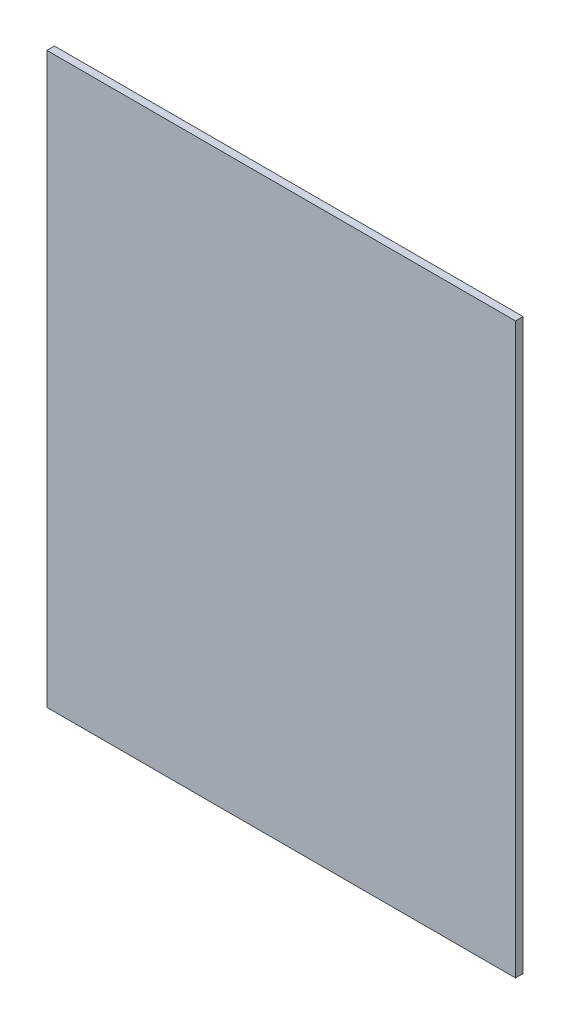
ISO-10303-21;
HEADER;
FILE_DESCRIPTION(('STEP AP214'),'2;1');
FILE_NAME('part.step','',(''),(''),'','','');
FILE_SCHEMA(('AUTOMOTIVE_DESIGN { 1 0 10303 214 1 1 1 1 }'));
ENDSEC;
DATA;
#1=APPLICATION_CONTEXT('core data for automotive mechanical design processes');
#2=APPLICATION_PROTOCOL_DEFINITION('international standard','automotive_design',2000,#1);
#3=PRODUCT_CONTEXT('',#1,'mechanical');
#4=PRODUCT('Part','Part','',(#3));
#5=PRODUCT_RELATED_PRODUCT_CATEGORY('part','',(#4));
#6=PRODUCT_DEFINITION_FORMATION('','',#4);
#7=PRODUCT_DEFINITION_CONTEXT('part definition',#1,'design');
#8=PRODUCT_DEFINITION('design','',#6,#7);
#9=PRODUCT_DEFINITION_SHAPE('','',#8);
#10=(LENGTH_UNIT() NAMED_UNIT(*) SI_UNIT(.MILLI.,.METRE.));
#11=(NAMED_UNIT(*) PLANE_ANGLE_UNIT() SI_UNIT($,.RADIAN.));
#12=(NAMED_UNIT(*) SI_UNIT($,.STERADIAN.) SOLID_ANGLE_UNIT());
#13=UNCERTAINTY_MEASURE_WITH_UNIT(LENGTH_MEASURE(1.E-05),#10,'distance_accuracy_value','');
#14=(GEOMETRIC_REPRESENTATION_CONTEXT(3) GLOBAL_UNCERTAINTY_ASSIGNED_CONTEXT((#13)) GLOBAL_UNIT_ASSIGNED_CONTEXT((#10,
#11,#12)) REPRESENTATION_CONTEXT('',''));
#15=CARTESIAN_POINT('',(0.,0.,0.));
#16=DIRECTION('',(0.,0.,1.));
#17=DIRECTION('',(1.,0.,0.));
#18=AXIS2_PLACEMENT_3D('',#15,#16,#17);
#19=CARTESIAN_POINT('',(98.425,-119.5,3.175));
#20=DIRECTION('',(-1.,0.,0.));
#21=DIRECTION('',(0.,0.,1.));
#22=AXIS2_PLACEMENT_3D('',#19,#20,#21);
#23=PLANE('',#22);
#24=DIRECTION('',(0.,1.,0.));
#25=VECTOR('',#24,1.);
#26=CARTESIAN_POINT('',(98.425,-119.5,0.));
#27=LINE('',#26,#25);
#28=CARTESIAN_POINT('',(98.425,-119.5,0.));
#29=VERTEX_POINT('',#28);
#30=CARTESIAN_POINT('',(98.425,119.5,0.));
#31=VERTEX_POINT('',#30);
#32=EDGE_CURVE('E118',#29,#31,#27,.T.);
#33=ORIENTED_EDGE('',*,*,#32,.T.);
#34=DIRECTION('',(0.,0.,-1.));
#35=VECTOR('',#34,1.);
#36=CARTESIAN_POINT('',(98.425,119.5,3.175));
#37=LINE('',#36,#35);
#38=CARTESIAN_POINT('',(98.425,119.5,3.175));
#39=VERTEX_POINT('',#38);
#40=EDGE_CURVE('E11',#39,#31,#37,.T.);
#41=ORIENTED_EDGE('',*,*,#40,.F.);
#42=DIRECTION('',(0.,1.,0.));
#43=VECTOR('',#42,1.);
#44=CARTESIAN_POINT('',(98.425,-119.5,3.175));
#45=LINE('',#44,#43);
#46=CARTESIAN_POINT('',(98.425,-119.5,3.175));
#47=VERTEX_POINT('',#46);
#48=EDGE_CURVE('E99',#47,#39,#45,.T.);
#49=ORIENTED_EDGE('',*,*,#48,.F.);
#50=DIRECTION('',(0.,0.,-1.));
#51=VECTOR('',#50,1.);
#52=CARTESIAN_POINT('',(98.425,-119.5,3.175));
#53=LINE('',#52,#51);
#54=EDGE_CURVE('E114',#47,#29,#53,.T.);
#55=ORIENTED_EDGE('',*,*,#54,.T.);
#56=EDGE_LOOP('',(#33,#41,#49,#55));
#57=FACE_BOUND('',#56,.T.);
#58=ADVANCED_FACE('F47',(#57),#23,.F.);
#59=CARTESIAN_POINT('',(-98.425,119.5,3.175));
#60=DIRECTION('',(0.,-1.,0.));
#61=DIRECTION('',(0.,0.,-1.));
#62=AXIS2_PLACEMENT_3D('',#59,#60,#61);
#63=PLANE('',#62);
#64=DIRECTION('',(-1.,0.,0.));
#65=VECTOR('',#64,1.);
#66=CARTESIAN_POINT('',(-98.425,119.5,0.));
#67=LINE('',#66,#65);
#68=CARTESIAN_POINT('',(-98.425,119.5,0.));
#69=VERTEX_POINT('',#68);
#70=EDGE_CURVE('E104',#31,#69,#67,.T.);
#71=ORIENTED_EDGE('',*,*,#70,.T.);
#72=DIRECTION('',(0.,0.,-1.));
#73=VECTOR('',#72,1.);
#74=CARTESIAN_POINT('',(-98.425,119.5,3.175));
#75=LINE('',#74,#73);
#76=CARTESIAN_POINT('',(-98.425,119.5,3.175));
#77=VERTEX_POINT('',#76);
#78=EDGE_CURVE('E56',#77,#69,#75,.T.);
#79=ORIENTED_EDGE('',*,*,#78,.F.);
#80=DIRECTION('',(-1.,0.,0.));
#81=VECTOR('',#80,1.);
#82=CARTESIAN_POINT('',(-98.425,119.5,3.175));
#83=LINE('',#82,#81);
#84=EDGE_CURVE('E94',#39,#77,#83,.T.);
#85=ORIENTED_EDGE('',*,*,#84,.F.);
#86=ORIENTED_EDGE('',*,*,#40,.T.);
#87=EDGE_LOOP('',(#71,#79,#85,#86));
#88=FACE_BOUND('',#87,.T.);
#89=ADVANCED_FACE('F103',(#88),#63,.F.);
#90=CARTESIAN_POINT('',(-98.425,-119.5,3.175));
#91=DIRECTION('',(1.,0.,0.));
#92=DIRECTION('',(0.,0.,-1.));
#93=AXIS2_PLACEMENT_3D('',#90,#91,#92);
#94=PLANE('',#93);
#95=DIRECTION('',(0.,-1.,0.));
#96=VECTOR('',#95,1.);
#97=CARTESIAN_POINT('',(-98.425,-119.5,0.));
#98=LINE('',#97,#96);
#99=CARTESIAN_POINT('',(-98.425,-119.5,0.));
#100=VERTEX_POINT('',#99);
#101=EDGE_CURVE('E81',#69,#100,#98,.T.);
#102=ORIENTED_EDGE('',*,*,#101,.T.);
#103=DIRECTION('',(0.,0.,-1.));
#104=VECTOR('',#103,1.);
#105=CARTESIAN_POINT('',(-98.425,-119.5,3.175));
#106=LINE('',#105,#104);
#107=CARTESIAN_POINT('',(-98.425,-119.5,3.175));
#108=VERTEX_POINT('',#107);
#109=EDGE_CURVE('E106',#108,#100,#106,.T.);
#110=ORIENTED_EDGE('',*,*,#109,.F.);
#111=DIRECTION('',(0.,-1.,0.));
#112=VECTOR('',#111,1.);
#113=CARTESIAN_POINT('',(-98.425,-119.5,3.175));
#114=LINE('',#113,#112);
#115=EDGE_CURVE('E97',#77,#108,#114,.T.);
#116=ORIENTED_EDGE('',*,*,#115,.F.);
#117=ORIENTED_EDGE('',*,*,#78,.T.);
#118=EDGE_LOOP('',(#102,#110,#116,#117));
#119=FACE_BOUND('',#118,.T.);
#120=ADVANCED_FACE('F107',(#119),#94,.F.);
#121=CARTESIAN_POINT('',(-98.425,-119.5,3.175));
#122=DIRECTION('',(0.,1.,0.));
#123=DIRECTION('',(0.,0.,1.));
#124=AXIS2_PLACEMENT_3D('',#121,#122,#123);
#125=PLANE('',#124);
#126=DIRECTION('',(1.,0.,0.));
#127=VECTOR('',#126,1.);
#128=CARTESIAN_POINT('',(-98.425,-119.5,0.));
#129=LINE('',#128,#127);
#130=EDGE_CURVE('E87',#100,#29,#129,.T.);
#131=ORIENTED_EDGE('',*,*,#130,.T.);
#132=ORIENTED_EDGE('',*,*,#54,.F.);
#133=DIRECTION('',(1.,0.,0.));
#134=VECTOR('',#133,1.);
#135=CARTESIAN_POINT('',(-98.425,-119.5,3.175));
#136=LINE('',#135,#134);
#137=EDGE_CURVE('E64',#108,#47,#136,.T.);
#138=ORIENTED_EDGE('',*,*,#137,.F.);
#139=ORIENTED_EDGE('',*,*,#109,.T.);
#140=EDGE_LOOP('',(#131,#132,#138,#139));
#141=FACE_BOUND('',#140,.T.);
#142=ADVANCED_FACE('F130',(#141),#125,.F.);
#143=CARTESIAN_POINT('',(0.,0.,3.175));
#144=DIRECTION('',(0.,0.,-1.));
#145=DIRECTION('',(-1.,0.,0.));
#146=AXIS2_PLACEMENT_3D('',#143,#144,#145);
#147=PLANE('',#146);
#148=ORIENTED_EDGE('',*,*,#48,.T.);
#149=ORIENTED_EDGE('',*,*,#84,.T.);
#150=ORIENTED_EDGE('',*,*,#115,.T.);
#151=ORIENTED_EDGE('',*,*,#137,.T.);
#152=EDGE_LOOP('',(#148,#149,#150,#151));
#153=FACE_BOUND('',#152,.T.);
#154=ADVANCED_FACE('F95',(#153),#147,.F.);
#155=CARTESIAN_POINT('',(0.,0.,0.));
#156=DIRECTION('',(0.,0.,-1.));
#157=DIRECTION('',(-1.,0.,0.));
#158=AXIS2_PLACEMENT_3D('',#155,#156,#157);
#159=PLANE('',#158);
#160=ORIENTED_EDGE('',*,*,#32,.F.);
#161=ORIENTED_EDGE('',*,*,#130,.F.);
#162=ORIENTED_EDGE('',*,*,#101,.F.);
#163=ORIENTED_EDGE('',*,*,#70,.F.);
#164=EDGE_LOOP('',(#160,#161,#162,#163));
#165=FACE_BOUND('',#164,.T.);
#166=ADVANCED_FACE('F133',(#165),#159,.T.);
#167=CLOSED_SHELL('',(#58,#89,#120,#142,#154,#166));
#168=MANIFOLD_SOLID_BREP('B2',#167);
#169=ADVANCED_BREP_SHAPE_REPRESENTATION('',(#18,#168),#14);
#170=SHAPE_DEFINITION_REPRESENTATION(#9,#169);
ENDSEC;
END-ISO-10303-21;
